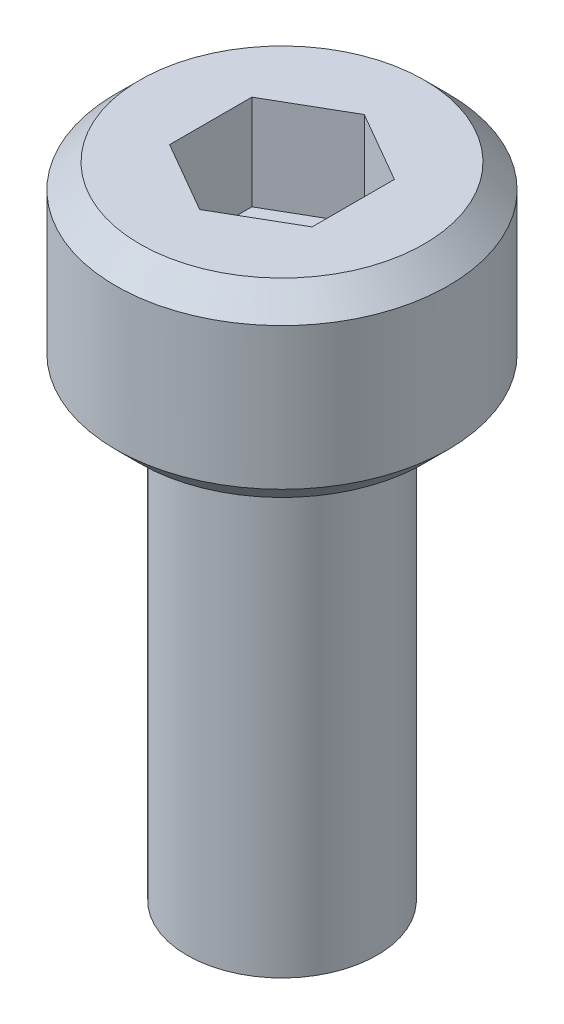
ISO-10303-21;
HEADER;
FILE_DESCRIPTION(('STEP AP214'),'2;1');
FILE_NAME('part.step','',(''),(''),'','','');
FILE_SCHEMA(('AUTOMOTIVE_DESIGN { 1 0 10303 214 1 1 1 1 }'));
ENDSEC;
DATA;
#1=APPLICATION_CONTEXT('core data for automotive mechanical design processes');
#2=APPLICATION_PROTOCOL_DEFINITION('international standard','automotive_design',2000,#1);
#3=PRODUCT_CONTEXT('',#1,'mechanical');
#4=PRODUCT('Part','Part','',(#3));
#5=PRODUCT_RELATED_PRODUCT_CATEGORY('part','',(#4));
#6=PRODUCT_DEFINITION_FORMATION('','',#4);
#7=PRODUCT_DEFINITION_CONTEXT('part definition',#1,'design');
#8=PRODUCT_DEFINITION('design','',#6,#7);
#9=PRODUCT_DEFINITION_SHAPE('','',#8);
#10=(LENGTH_UNIT() NAMED_UNIT(*) SI_UNIT(.MILLI.,.METRE.));
#11=(NAMED_UNIT(*) PLANE_ANGLE_UNIT() SI_UNIT($,.RADIAN.));
#12=(NAMED_UNIT(*) SI_UNIT($,.STERADIAN.) SOLID_ANGLE_UNIT());
#13=UNCERTAINTY_MEASURE_WITH_UNIT(LENGTH_MEASURE(1.E-05),#10,'distance_accuracy_value','');
#14=(GEOMETRIC_REPRESENTATION_CONTEXT(3) GLOBAL_UNCERTAINTY_ASSIGNED_CONTEXT((#13)) GLOBAL_UNIT_ASSIGNED_CONTEXT((#10,
#11,#12)) REPRESENTATION_CONTEXT('',''));
#15=CARTESIAN_POINT('',(0.,0.,0.));
#16=DIRECTION('',(0.,0.,1.));
#17=DIRECTION('',(1.,0.,0.));
#18=AXIS2_PLACEMENT_3D('',#15,#16,#17);
#19=CARTESIAN_POINT('',(0.,1.99999199999999,-1.73205080756887));
#20=DIRECTION('',(-0.5,0.,-0.866025403784439));
#21=DIRECTION('',(-0.866025403784439,0.,0.5));
#22=AXIS2_PLACEMENT_3D('',#19,#20,#21);
#23=PLANE('',#22);
#24=DIRECTION('',(0.,-1.,0.));
#25=VECTOR('',#24,1.);
#26=CARTESIAN_POINT('',(-1.49999999999999,1.99999199999999,-0.866025403784432));
#27=LINE('',#26,#25);
#28=CARTESIAN_POINT('',(-1.49999999999999,3.99999199999999,-0.86602540378443));
#29=VERTEX_POINT('',#28);
#30=CARTESIAN_POINT('',(-1.49999999999999,1.99999199999999,-0.86602540378443));
#31=VERTEX_POINT('',#30);
#32=EDGE_CURVE('E83',#29,#31,#27,.T.);
#33=ORIENTED_EDGE('',*,*,#32,.T.);
#34=DIRECTION('',(-0.866025403784439,0.,0.5));
#35=VECTOR('',#34,1.);
#36=CARTESIAN_POINT('',(0.,1.99999199999999,-1.73205080756887));
#37=LINE('',#36,#35);
#38=CARTESIAN_POINT('',(0.,1.999992,-1.73205080756887));
#39=VERTEX_POINT('',#38);
#40=EDGE_CURVE('E72',#39,#31,#37,.T.);
#41=ORIENTED_EDGE('',*,*,#40,.F.);
#42=DIRECTION('',(0.,1.,0.));
#43=VECTOR('',#42,1.);
#44=CARTESIAN_POINT('',(0.,1.99999200000003,-1.73205080756886));
#45=LINE('',#44,#43);
#46=CARTESIAN_POINT('',(0.,3.99999200000001,-1.73205080756887));
#47=VERTEX_POINT('',#46);
#48=EDGE_CURVE('E92',#39,#47,#45,.T.);
#49=ORIENTED_EDGE('',*,*,#48,.T.);
#50=DIRECTION('',(-0.866025403784439,0.,0.5));
#51=VECTOR('',#50,1.);
#52=CARTESIAN_POINT('',(0.,3.99999199999999,-1.73205080756887));
#53=LINE('',#52,#51);
#54=EDGE_CURVE('E67',#29,#47,#53,.F.);
#55=ORIENTED_EDGE('',*,*,#54,.F.);
#56=EDGE_LOOP('',(#33,#41,#49,#55));
#57=FACE_BOUND('',#56,.T.);
#58=ADVANCED_FACE('F17',(#57),#23,.F.);
#59=CARTESIAN_POINT('',(-1.49999999999999,1.99999199999999,-0.866025403784432));
#60=DIRECTION('',(-1.,0.,0.));
#61=DIRECTION('',(0.,-1.,0.));
#62=AXIS2_PLACEMENT_3D('',#59,#60,#61);
#63=PLANE('',#62);
#64=DIRECTION('',(0.,1.,0.));
#65=VECTOR('',#64,1.);
#66=CARTESIAN_POINT('',(-1.49999999999999,1.99999199999999,0.866025403784441));
#67=LINE('',#66,#65);
#68=CARTESIAN_POINT('',(-1.49999999999999,3.99999199999999,0.866025403784443));
#69=VERTEX_POINT('',#68);
#70=CARTESIAN_POINT('',(-1.49999999999999,1.99999199999999,0.866025403784439));
#71=VERTEX_POINT('',#70);
#72=EDGE_CURVE('E88',#69,#71,#67,.F.);
#73=ORIENTED_EDGE('',*,*,#72,.T.);
#74=DIRECTION('',(0.,0.,1.));
#75=VECTOR('',#74,1.);
#76=CARTESIAN_POINT('',(-1.49999999999999,1.99999199999999,-0.866025403784432));
#77=LINE('',#76,#75);
#78=EDGE_CURVE('E76',#31,#71,#77,.T.);
#79=ORIENTED_EDGE('',*,*,#78,.F.);
#80=ORIENTED_EDGE('',*,*,#32,.F.);
#81=DIRECTION('',(0.,0.,1.));
#82=VECTOR('',#81,1.);
#83=CARTESIAN_POINT('',(-1.49999999999999,3.99999199999999,-0.866025403784432));
#84=LINE('',#83,#82);
#85=EDGE_CURVE('E90',#69,#29,#84,.F.);
#86=ORIENTED_EDGE('',*,*,#85,.F.);
#87=EDGE_LOOP('',(#73,#79,#80,#86));
#88=FACE_BOUND('',#87,.T.);
#89=ADVANCED_FACE('F86',(#88),#63,.F.);
#90=CARTESIAN_POINT('',(1.50000000000001,1.99999200000003,-0.866025403784422));
#91=DIRECTION('',(0.5,0.,-0.866025403784439));
#92=DIRECTION('',(-0.866025403784439,0.,-0.5));
#93=AXIS2_PLACEMENT_3D('',#90,#91,#92);
#94=PLANE('',#93);
#95=ORIENTED_EDGE('',*,*,#48,.F.);
#96=DIRECTION('',(-0.866025403784436,0.,-0.500000000000005));
#97=VECTOR('',#96,1.);
#98=CARTESIAN_POINT('',(1.50000000000001,1.99999199999999,-0.866025403784422));
#99=LINE('',#98,#97);
#100=CARTESIAN_POINT('',(1.5,1.999992,-0.866025403784425));
#101=VERTEX_POINT('',#100);
#102=EDGE_CURVE('E79',#101,#39,#99,.T.);
#103=ORIENTED_EDGE('',*,*,#102,.F.);
#104=DIRECTION('',(0.,1.,0.));
#105=VECTOR('',#104,1.);
#106=CARTESIAN_POINT('',(1.5,1.99999199999999,-0.866025403784422));
#107=LINE('',#106,#105);
#108=CARTESIAN_POINT('',(1.5,3.99999200000002,-0.866025403784425));
#109=VERTEX_POINT('',#108);
#110=EDGE_CURVE('E122',#101,#109,#107,.T.);
#111=ORIENTED_EDGE('',*,*,#110,.T.);
#112=DIRECTION('',(-0.866025403784439,0.,-0.5));
#113=VECTOR('',#112,1.);
#114=CARTESIAN_POINT('',(1.50000000000001,3.99999200000005,-0.866025403784422));
#115=LINE('',#114,#113);
#116=EDGE_CURVE('E134',#47,#109,#115,.F.);
#117=ORIENTED_EDGE('',*,*,#116,.F.);
#118=EDGE_LOOP('',(#95,#103,#111,#117));
#119=FACE_BOUND('',#118,.T.);
#120=ADVANCED_FACE('F137',(#119),#94,.F.);
#121=CARTESIAN_POINT('',(-1.49999999999999,1.99999199999999,0.866025403784439));
#122=DIRECTION('',(-0.5,0.,0.866025403784439));
#123=DIRECTION('',(0.866025403784439,0.,0.5));
#124=AXIS2_PLACEMENT_3D('',#121,#122,#123);
#125=PLANE('',#124);
#126=DIRECTION('',(0.,1.,0.));
#127=VECTOR('',#126,1.);
#128=CARTESIAN_POINT('',(0.,1.99999199999999,1.73205080756887));
#129=LINE('',#128,#127);
#130=CARTESIAN_POINT('',(0.,3.99999199999999,1.73205080756888));
#131=VERTEX_POINT('',#130);
#132=CARTESIAN_POINT('',(0.,1.99999199999999,1.73205080756887));
#133=VERTEX_POINT('',#132);
#134=EDGE_CURVE('E119',#131,#133,#129,.F.);
#135=ORIENTED_EDGE('',*,*,#134,.T.);
#136=DIRECTION('',(0.86602540378444,0.,0.499999999999998));
#137=VECTOR('',#136,1.);
#138=CARTESIAN_POINT('',(-1.49999999999999,1.99999199999999,0.866025403784439));
#139=LINE('',#138,#137);
#140=EDGE_CURVE('E128',#71,#133,#139,.T.);
#141=ORIENTED_EDGE('',*,*,#140,.F.);
#142=ORIENTED_EDGE('',*,*,#72,.F.);
#143=DIRECTION('',(0.866025403784439,0.,0.5));
#144=VECTOR('',#143,1.);
#145=CARTESIAN_POINT('',(-1.49999999999999,3.99999199999999,0.866025403784439));
#146=LINE('',#145,#144);
#147=EDGE_CURVE('E130',#131,#69,#146,.F.);
#148=ORIENTED_EDGE('',*,*,#147,.F.);
#149=EDGE_LOOP('',(#135,#141,#142,#148));
#150=FACE_BOUND('',#149,.T.);
#151=ADVANCED_FACE('F144',(#150),#125,.F.);
#152=CARTESIAN_POINT('',(1.5,1.99999199999999,2.5980762113533));
#153=DIRECTION('',(0.,1.,0.));
#154=DIRECTION('',(0.,0.,1.));
#155=AXIS2_PLACEMENT_3D('',#152,#153,#154);
#156=PLANE('',#155);
#157=ORIENTED_EDGE('',*,*,#40,.T.);
#158=ORIENTED_EDGE('',*,*,#78,.T.);
#159=ORIENTED_EDGE('',*,*,#140,.T.);
#160=DIRECTION('',(0.866025403784439,0.,-0.5));
#161=VECTOR('',#160,1.);
#162=CARTESIAN_POINT('',(0.,1.99999199999999,1.73205080756887));
#163=LINE('',#162,#161);
#164=CARTESIAN_POINT('',(1.5,1.99999199999999,0.866025403784437));
#165=VERTEX_POINT('',#164);
#166=EDGE_CURVE('E117',#133,#165,#163,.T.);
#167=ORIENTED_EDGE('',*,*,#166,.T.);
#168=DIRECTION('',(0.,0.,1.));
#169=VECTOR('',#168,1.);
#170=CARTESIAN_POINT('',(1.5,1.99999199999999,0.866025403784439));
#171=LINE('',#170,#169);
#172=EDGE_CURVE('E125',#165,#101,#171,.F.);
#173=ORIENTED_EDGE('',*,*,#172,.T.);
#174=ORIENTED_EDGE('',*,*,#102,.T.);
#175=EDGE_LOOP('',(#157,#158,#159,#167,#173,#174));
#176=FACE_BOUND('',#175,.T.);
#177=ADVANCED_FACE('F73',(#176),#156,.T.);
#178=CARTESIAN_POINT('',(1.5,1.99999199999999,0.866025403784439));
#179=DIRECTION('',(1.,0.,0.));
#180=DIRECTION('',(0.,1.,0.));
#181=AXIS2_PLACEMENT_3D('',#178,#179,#180);
#182=PLANE('',#181);
#183=ORIENTED_EDGE('',*,*,#110,.F.);
#184=ORIENTED_EDGE('',*,*,#172,.F.);
#185=DIRECTION('',(0.,1.,0.));
#186=VECTOR('',#185,1.);
#187=CARTESIAN_POINT('',(1.5,1.99999199999999,0.866025403784431));
#188=LINE('',#187,#186);
#189=CARTESIAN_POINT('',(1.5,3.99999199999999,0.866025403784437));
#190=VERTEX_POINT('',#189);
#191=EDGE_CURVE('E115',#165,#190,#188,.T.);
#192=ORIENTED_EDGE('',*,*,#191,.T.);
#193=DIRECTION('',(0.,0.,1.));
#194=VECTOR('',#193,1.);
#195=CARTESIAN_POINT('',(1.5,3.99999199999999,0.866025403784439));
#196=LINE('',#195,#194);
#197=EDGE_CURVE('E35',#109,#190,#196,.T.);
#198=ORIENTED_EDGE('',*,*,#197,.F.);
#199=EDGE_LOOP('',(#183,#184,#192,#198));
#200=FACE_BOUND('',#199,.T.);
#201=ADVANCED_FACE('F151',(#200),#182,.F.);
#202=CARTESIAN_POINT('',(0.,1.99999199999999,1.73205080756887));
#203=DIRECTION('',(0.5,0.,0.866025403784439));
#204=DIRECTION('',(0.866025403784439,0.,-0.5));
#205=AXIS2_PLACEMENT_3D('',#202,#203,#204);
#206=PLANE('',#205);
#207=ORIENTED_EDGE('',*,*,#191,.F.);
#208=ORIENTED_EDGE('',*,*,#166,.F.);
#209=ORIENTED_EDGE('',*,*,#134,.F.);
#210=DIRECTION('',(-0.866025403784435,0.,0.500000000000006));
#211=VECTOR('',#210,1.);
#212=CARTESIAN_POINT('',(1.5,3.99999199999999,0.866025403784439));
#213=LINE('',#212,#211);
#214=EDGE_CURVE('E113',#190,#131,#213,.T.);
#215=ORIENTED_EDGE('',*,*,#214,.F.);
#216=EDGE_LOOP('',(#207,#208,#209,#215));
#217=FACE_BOUND('',#216,.T.);
#218=ADVANCED_FACE('F149',(#217),#206,.F.);
#219=CARTESIAN_POINT('',(0.,3.99999199999999,0.));
#220=DIRECTION('',(0.,1.,0.));
#221=DIRECTION('',(0.,0.,1.));
#222=AXIS2_PLACEMENT_3D('',#219,#220,#221);
#223=PLANE('',#222);
#224=ORIENTED_EDGE('',*,*,#197,.T.);
#225=ORIENTED_EDGE('',*,*,#214,.T.);
#226=ORIENTED_EDGE('',*,*,#147,.T.);
#227=ORIENTED_EDGE('',*,*,#85,.T.);
#228=ORIENTED_EDGE('',*,*,#54,.T.);
#229=ORIENTED_EDGE('',*,*,#116,.T.);
#230=EDGE_LOOP('',(#224,#225,#226,#227,#228,#229));
#231=FACE_BOUND('',#230,.T.);
#232=CARTESIAN_POINT('',(0.,3.99999199993317,0.));
#233=DIRECTION('',(0.,-1.,0.));
#234=DIRECTION('',(0.,0.,-1.));
#235=AXIS2_PLACEMENT_3D('',#232,#233,#234);
#236=CIRCLE('',#235,2.9920000000061);
#237=CARTESIAN_POINT('',(0.,3.99999199993317,-2.9920000000061));
#238=VERTEX_POINT('',#237);
#239=EDGE_CURVE('E20',#238,#238,#236,.T.);
#240=ORIENTED_EDGE('',*,*,#239,.F.);
#241=EDGE_LOOP('',(#240));
#242=FACE_BOUND('',#241,.T.);
#243=ADVANCED_FACE('F139',(#231,#242),#223,.T.);
#244=CARTESIAN_POINT('',(0.,3.49199200013572,0.));
#245=DIRECTION('',(0.,-1.,0.));
#246=DIRECTION('',(0.,0.,-1.));
#247=AXIS2_PLACEMENT_3D('',#244,#245,#246);
#248=CONICAL_SURFACE('',#247,3.49999999980355,0.785398163397448);
#249=ORIENTED_EDGE('',*,*,#239,.T.);
#250=EDGE_LOOP('',(#249));
#251=FACE_BOUND('',#250,.T.);
#252=CARTESIAN_POINT('',(0.,3.491992,0.));
#253=DIRECTION('',(0.,-1.,0.));
#254=DIRECTION('',(0.,0.,-1.));
#255=AXIS2_PLACEMENT_3D('',#252,#253,#254);
#256=CIRCLE('',#255,3.5);
#257=CARTESIAN_POINT('',(0.,3.491992,-3.5));
#258=VERTEX_POINT('',#257);
#259=EDGE_CURVE('E105',#258,#258,#256,.T.);
#260=ORIENTED_EDGE('',*,*,#259,.F.);
#261=EDGE_LOOP('',(#260));
#262=FACE_BOUND('',#261,.T.);
#263=ADVANCED_FACE('F188',(#251,#262),#248,.T.);
#264=CARTESIAN_POINT('',(0.,3.99999199999999,0.));
#265=DIRECTION('',(0.,-1.,0.));
#266=DIRECTION('',(0.,0.,-1.));
#267=AXIS2_PLACEMENT_3D('',#264,#265,#266);
#268=CYLINDRICAL_SURFACE('',#267,3.5);
#269=ORIENTED_EDGE('',*,*,#259,.T.);
#270=EDGE_LOOP('',(#269));
#271=FACE_BOUND('',#270,.T.);
#272=CARTESIAN_POINT('',(0.,0.507999999967979,0.));
#273=DIRECTION('',(0.,1.,0.));
#274=DIRECTION('',(0.,0.,1.));
#275=AXIS2_PLACEMENT_3D('',#272,#273,#274);
#276=CIRCLE('',#275,3.49999999997408);
#277=CARTESIAN_POINT('',(0.,0.507999999967979,3.49999999997408));
#278=VERTEX_POINT('',#277);
#279=EDGE_CURVE('E101',#278,#278,#276,.F.);
#280=ORIENTED_EDGE('',*,*,#279,.F.);
#281=EDGE_LOOP('',(#280));
#282=FACE_BOUND('',#281,.T.);
#283=ADVANCED_FACE('F184',(#271,#282),#268,.T.);
#284=CARTESIAN_POINT('',(0.,-10.,0.));
#285=DIRECTION('',(0.,1.,0.));
#286=DIRECTION('',(0.,0.,1.));
#287=AXIS2_PLACEMENT_3D('',#284,#285,#286);
#288=PLANE('',#287);
#289=CARTESIAN_POINT('',(0.,-10.000000000025,0.));
#290=DIRECTION('',(0.,1.,0.));
#291=DIRECTION('',(0.,0.,1.));
#292=AXIS2_PLACEMENT_3D('',#289,#290,#291);
#293=CIRCLE('',#292,1.23038000003818);
#294=CARTESIAN_POINT('',(0.,-10.000000000025,1.23038000003817));
#295=VERTEX_POINT('',#294);
#296=EDGE_CURVE('E99',#295,#295,#293,.T.);
#297=ORIENTED_EDGE('',*,*,#296,.F.);
#298=EDGE_LOOP('',(#297));
#299=FACE_BOUND('',#298,.T.);
#300=ADVANCED_FACE('F180',(#299),#288,.F.);
#301=CARTESIAN_POINT('',(0.,0.507999999967979,0.));
#302=DIRECTION('',(0.,1.,0.));
#303=DIRECTION('',(0.,0.,1.));
#304=AXIS2_PLACEMENT_3D('',#301,#302,#303);
#305=CONICAL_SURFACE('',#304,3.49999999997408,0.785398163453397);
#306=CARTESIAN_POINT('',(0.,0.,0.));
#307=DIRECTION('',(0.,1.,0.));
#308=DIRECTION('',(0.,0.,1.));
#309=AXIS2_PLACEMENT_3D('',#306,#307,#308);
#310=CIRCLE('',#309,2.99199999994926);
#311=CARTESIAN_POINT('',(0.,0.,2.99199999994926));
#312=VERTEX_POINT('',#311);
#313=EDGE_CURVE('E97',#312,#312,#310,.T.);
#314=ORIENTED_EDGE('',*,*,#313,.T.);
#315=EDGE_LOOP('',(#314));
#316=FACE_BOUND('',#315,.T.);
#317=ORIENTED_EDGE('',*,*,#279,.T.);
#318=EDGE_LOOP('',(#317));
#319=FACE_BOUND('',#318,.T.);
#320=ADVANCED_FACE('F176',(#316,#319),#305,.T.);
#321=CARTESIAN_POINT('',(0.,-9.46152000005895,0.));
#322=DIRECTION('',(0.,1.,0.));
#323=DIRECTION('',(0.,0.,1.));
#324=AXIS2_PLACEMENT_3D('',#321,#322,#323);
#325=CONICAL_SURFACE('',#324,1.99999999995272,0.960291895387899);
#326=CARTESIAN_POINT('',(0.,-9.46152,0.));
#327=DIRECTION('',(0.,1.,0.));
#328=DIRECTION('',(0.,0.,1.));
#329=AXIS2_PLACEMENT_3D('',#326,#327,#328);
#330=CIRCLE('',#329,2.);
#331=CARTESIAN_POINT('',(0.,-9.46152,1.99999999999999));
#332=VERTEX_POINT('',#331);
#333=EDGE_CURVE('E26',#332,#332,#330,.T.);
#334=ORIENTED_EDGE('',*,*,#333,.F.);
#335=EDGE_LOOP('',(#334));
#336=FACE_BOUND('',#335,.T.);
#337=ORIENTED_EDGE('',*,*,#296,.T.);
#338=EDGE_LOOP('',(#337));
#339=FACE_BOUND('',#338,.T.);
#340=ADVANCED_FACE('F169',(#336,#339),#325,.T.);
#341=CARTESIAN_POINT('',(0.,0.,0.));
#342=DIRECTION('',(0.,1.,0.));
#343=DIRECTION('',(0.,0.,1.));
#344=AXIS2_PLACEMENT_3D('',#341,#342,#343);
#345=PLANE('',#344);
#346=CARTESIAN_POINT('',(0.,0.,0.));
#347=DIRECTION('',(0.,1.,0.));
#348=DIRECTION('',(0.,0.,1.));
#349=AXIS2_PLACEMENT_3D('',#346,#347,#348);
#350=CIRCLE('',#349,2.);
#351=CARTESIAN_POINT('',(0.,0.,1.99999999999999));
#352=VERTEX_POINT('',#351);
#353=EDGE_CURVE('E11',#352,#352,#350,.F.);
#354=ORIENTED_EDGE('',*,*,#353,.F.);
#355=EDGE_LOOP('',(#354));
#356=FACE_BOUND('',#355,.T.);
#357=ORIENTED_EDGE('',*,*,#313,.F.);
#358=EDGE_LOOP('',(#357));
#359=FACE_BOUND('',#358,.T.);
#360=ADVANCED_FACE('F163',(#356,#359),#345,.F.);
#361=CARTESIAN_POINT('',(0.,-10.,0.));
#362=DIRECTION('',(0.,1.,0.));
#363=DIRECTION('',(0.,0.,1.));
#364=AXIS2_PLACEMENT_3D('',#361,#362,#363);
#365=CYLINDRICAL_SURFACE('',#364,2.);
#366=ORIENTED_EDGE('',*,*,#353,.T.);
#367=EDGE_LOOP('',(#366));
#368=FACE_BOUND('',#367,.T.);
#369=ORIENTED_EDGE('',*,*,#333,.T.);
#370=EDGE_LOOP('',(#369));
#371=FACE_BOUND('',#370,.T.);
#372=ADVANCED_FACE('F161',(#368,#371),#365,.T.);
#373=CLOSED_SHELL('',(#58,#89,#120,#151,#177,#201,#218,#243,#263,#283,#300,#320,#340,#360,#372));
#374=MANIFOLD_SOLID_BREP('B1',#373);
#375=ADVANCED_BREP_SHAPE_REPRESENTATION('',(#18,#374),#14);
#376=SHAPE_DEFINITION_REPRESENTATION(#9,#375);
ENDSEC;
END-ISO-10303-21;
